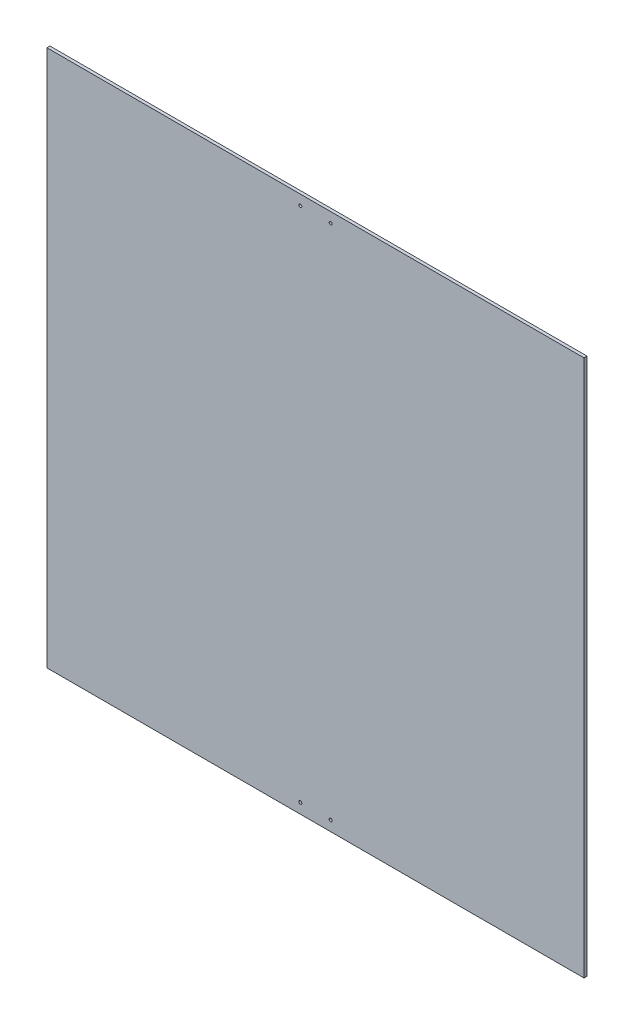
ISO-10303-21;
HEADER;
FILE_DESCRIPTION(('STEP AP214'),'2;1');
FILE_NAME('part.step','',(''),(''),'','','');
FILE_SCHEMA(('AUTOMOTIVE_DESIGN { 1 0 10303 214 1 1 1 1 }'));
ENDSEC;
DATA;
#1=APPLICATION_CONTEXT('core data for automotive mechanical design processes');
#2=APPLICATION_PROTOCOL_DEFINITION('international standard','automotive_design',2000,#1);
#3=PRODUCT_CONTEXT('',#1,'mechanical');
#4=PRODUCT('Part','Part','',(#3));
#5=PRODUCT_RELATED_PRODUCT_CATEGORY('part','',(#4));
#6=PRODUCT_DEFINITION_FORMATION('','',#4);
#7=PRODUCT_DEFINITION_CONTEXT('part definition',#1,'design');
#8=PRODUCT_DEFINITION('design','',#6,#7);
#9=PRODUCT_DEFINITION_SHAPE('','',#8);
#10=(LENGTH_UNIT() NAMED_UNIT(*) SI_UNIT(.MILLI.,.METRE.));
#11=(NAMED_UNIT(*) PLANE_ANGLE_UNIT() SI_UNIT($,.RADIAN.));
#12=(NAMED_UNIT(*) SI_UNIT($,.STERADIAN.) SOLID_ANGLE_UNIT());
#13=UNCERTAINTY_MEASURE_WITH_UNIT(LENGTH_MEASURE(1.E-05),#10,'distance_accuracy_value','');
#14=(GEOMETRIC_REPRESENTATION_CONTEXT(3) GLOBAL_UNCERTAINTY_ASSIGNED_CONTEXT((#13)) GLOBAL_UNIT_ASSIGNED_CONTEXT((#10,
#11,#12)) REPRESENTATION_CONTEXT('',''));
#15=CARTESIAN_POINT('',(0.,0.,0.));
#16=DIRECTION('',(0.,0.,1.));
#17=DIRECTION('',(1.,0.,0.));
#18=AXIS2_PLACEMENT_3D('',#15,#16,#17);
#19=CARTESIAN_POINT('',(0.,0.,3.));
#20=DIRECTION('',(-1.,0.,0.));
#21=DIRECTION('',(0.,0.,1.));
#22=AXIS2_PLACEMENT_3D('',#19,#20,#21);
#23=PLANE('',#22);
#24=DIRECTION('',(0.,1.,0.));
#25=VECTOR('',#24,1.);
#26=CARTESIAN_POINT('',(0.,0.,0.));
#27=LINE('',#26,#25);
#28=CARTESIAN_POINT('',(0.,0.,0.));
#29=VERTEX_POINT('',#28);
#30=CARTESIAN_POINT('',(0.,530.,0.));
#31=VERTEX_POINT('',#30);
#32=EDGE_CURVE('E96',#29,#31,#27,.T.);
#33=ORIENTED_EDGE('',*,*,#32,.T.);
#34=DIRECTION('',(0.,0.,-1.));
#35=VECTOR('',#34,1.);
#36=CARTESIAN_POINT('',(0.,530.,3.));
#37=LINE('',#36,#35);
#38=CARTESIAN_POINT('',(0.,530.,3.));
#39=VERTEX_POINT('',#38);
#40=EDGE_CURVE('E11',#39,#31,#37,.T.);
#41=ORIENTED_EDGE('',*,*,#40,.F.);
#42=DIRECTION('',(0.,1.,0.));
#43=VECTOR('',#42,1.);
#44=CARTESIAN_POINT('',(0.,0.,3.));
#45=LINE('',#44,#43);
#46=CARTESIAN_POINT('',(0.,0.,3.));
#47=VERTEX_POINT('',#46);
#48=EDGE_CURVE('E84',#47,#39,#45,.T.);
#49=ORIENTED_EDGE('',*,*,#48,.F.);
#50=DIRECTION('',(0.,0.,-1.));
#51=VECTOR('',#50,1.);
#52=CARTESIAN_POINT('',(0.,0.,3.));
#53=LINE('',#52,#51);
#54=EDGE_CURVE('E92',#47,#29,#53,.T.);
#55=ORIENTED_EDGE('',*,*,#54,.T.);
#56=EDGE_LOOP('',(#33,#41,#49,#55));
#57=FACE_BOUND('',#56,.T.);
#58=ADVANCED_FACE('F33',(#57),#23,.F.);
#59=CARTESIAN_POINT('',(0.,530.,3.));
#60=DIRECTION('',(0.,-1.,0.));
#61=DIRECTION('',(1.,0.,0.));
#62=AXIS2_PLACEMENT_3D('',#59,#60,#61);
#63=PLANE('',#62);
#64=DIRECTION('',(-1.,0.,0.));
#65=VECTOR('',#64,1.);
#66=CARTESIAN_POINT('',(0.,530.,0.));
#67=LINE('',#66,#65);
#68=CARTESIAN_POINT('',(-530.,530.,0.));
#69=VERTEX_POINT('',#68);
#70=EDGE_CURVE('E88',#31,#69,#67,.T.);
#71=ORIENTED_EDGE('',*,*,#70,.T.);
#72=DIRECTION('',(0.,0.,-1.));
#73=VECTOR('',#72,1.);
#74=CARTESIAN_POINT('',(-530.,530.,3.));
#75=LINE('',#74,#73);
#76=CARTESIAN_POINT('',(-530.,530.,3.));
#77=VERTEX_POINT('',#76);
#78=EDGE_CURVE('E41',#77,#69,#75,.T.);
#79=ORIENTED_EDGE('',*,*,#78,.F.);
#80=DIRECTION('',(-1.,0.,0.));
#81=VECTOR('',#80,1.);
#82=CARTESIAN_POINT('',(0.,530.,3.));
#83=LINE('',#82,#81);
#84=EDGE_CURVE('E79',#39,#77,#83,.T.);
#85=ORIENTED_EDGE('',*,*,#84,.F.);
#86=ORIENTED_EDGE('',*,*,#40,.T.);
#87=EDGE_LOOP('',(#71,#79,#85,#86));
#88=FACE_BOUND('',#87,.T.);
#89=ADVANCED_FACE('F87',(#88),#63,.F.);
#90=CARTESIAN_POINT('',(-530.,0.,3.));
#91=DIRECTION('',(1.,0.,0.));
#92=DIRECTION('',(0.,0.,-1.));
#93=AXIS2_PLACEMENT_3D('',#90,#91,#92);
#94=PLANE('',#93);
#95=DIRECTION('',(0.,-1.,0.));
#96=VECTOR('',#95,1.);
#97=CARTESIAN_POINT('',(-530.,0.,0.));
#98=LINE('',#97,#96);
#99=CARTESIAN_POINT('',(-530.,0.,0.));
#100=VERTEX_POINT('',#99);
#101=EDGE_CURVE('E66',#69,#100,#98,.T.);
#102=ORIENTED_EDGE('',*,*,#101,.T.);
#103=DIRECTION('',(0.,0.,-1.));
#104=VECTOR('',#103,1.);
#105=CARTESIAN_POINT('',(-530.,0.,3.));
#106=LINE('',#105,#104);
#107=CARTESIAN_POINT('',(-530.,0.,3.));
#108=VERTEX_POINT('',#107);
#109=EDGE_CURVE('E89',#108,#100,#106,.T.);
#110=ORIENTED_EDGE('',*,*,#109,.F.);
#111=DIRECTION('',(0.,-1.,0.));
#112=VECTOR('',#111,1.);
#113=CARTESIAN_POINT('',(-530.,0.,3.));
#114=LINE('',#113,#112);
#115=EDGE_CURVE('E82',#77,#108,#114,.T.);
#116=ORIENTED_EDGE('',*,*,#115,.F.);
#117=ORIENTED_EDGE('',*,*,#78,.T.);
#118=EDGE_LOOP('',(#102,#110,#116,#117));
#119=FACE_BOUND('',#118,.T.);
#120=ADVANCED_FACE('F90',(#119),#94,.F.);
#121=CARTESIAN_POINT('',(0.,0.,3.));
#122=DIRECTION('',(0.,1.,0.));
#123=DIRECTION('',(-1.,0.,0.));
#124=AXIS2_PLACEMENT_3D('',#121,#122,#123);
#125=PLANE('',#124);
#126=DIRECTION('',(1.,0.,0.));
#127=VECTOR('',#126,1.);
#128=CARTESIAN_POINT('',(0.,0.,0.));
#129=LINE('',#128,#127);
#130=EDGE_CURVE('E72',#100,#29,#129,.T.);
#131=ORIENTED_EDGE('',*,*,#130,.T.);
#132=ORIENTED_EDGE('',*,*,#54,.F.);
#133=DIRECTION('',(1.,0.,0.));
#134=VECTOR('',#133,1.);
#135=CARTESIAN_POINT('',(0.,0.,3.));
#136=LINE('',#135,#134);
#137=EDGE_CURVE('E49',#108,#47,#136,.T.);
#138=ORIENTED_EDGE('',*,*,#137,.F.);
#139=ORIENTED_EDGE('',*,*,#109,.T.);
#140=EDGE_LOOP('',(#131,#132,#138,#139));
#141=FACE_BOUND('',#140,.T.);
#142=ADVANCED_FACE('F104',(#141),#125,.F.);
#143=CARTESIAN_POINT('',(0.,530.,3.));
#144=DIRECTION('',(0.,0.,1.));
#145=DIRECTION('',(1.,0.,0.));
#146=AXIS2_PLACEMENT_3D('',#143,#144,#145);
#147=PLANE('',#146);
#148=CARTESIAN_POINT('',(-280.,520.,3.));
#149=DIRECTION('',(0.,0.,1.));
#150=DIRECTION('',(-1.,0.,0.));
#151=AXIS2_PLACEMENT_3D('',#148,#149,#150);
#152=CIRCLE('',#151,1.50000000000002);
#153=CARTESIAN_POINT('',(-281.5,520.,3.));
#154=VERTEX_POINT('',#153);
#155=EDGE_CURVE('E128',#154,#154,#152,.T.);
#156=ORIENTED_EDGE('',*,*,#155,.F.);
#157=EDGE_LOOP('',(#156));
#158=FACE_BOUND('',#157,.T.);
#159=CARTESIAN_POINT('',(-250.,520.,3.));
#160=DIRECTION('',(0.,0.,1.));
#161=DIRECTION('',(-1.,0.,0.));
#162=AXIS2_PLACEMENT_3D('',#159,#160,#161);
#163=CIRCLE('',#162,1.50000000000002);
#164=CARTESIAN_POINT('',(-251.5,520.,3.));
#165=VERTEX_POINT('',#164);
#166=EDGE_CURVE('E122',#165,#165,#163,.T.);
#167=ORIENTED_EDGE('',*,*,#166,.F.);
#168=EDGE_LOOP('',(#167));
#169=FACE_BOUND('',#168,.T.);
#170=CARTESIAN_POINT('',(-280.,10.,3.));
#171=DIRECTION('',(0.,0.,1.));
#172=DIRECTION('',(1.,0.,0.));
#173=AXIS2_PLACEMENT_3D('',#170,#171,#172);
#174=CIRCLE('',#173,1.50000000000002);
#175=CARTESIAN_POINT('',(-278.5,10.,3.));
#176=VERTEX_POINT('',#175);
#177=EDGE_CURVE('E116',#176,#176,#174,.T.);
#178=ORIENTED_EDGE('',*,*,#177,.F.);
#179=EDGE_LOOP('',(#178));
#180=FACE_BOUND('',#179,.T.);
#181=CARTESIAN_POINT('',(-250.,10.,3.));
#182=DIRECTION('',(0.,0.,1.));
#183=DIRECTION('',(1.,0.,0.));
#184=AXIS2_PLACEMENT_3D('',#181,#182,#183);
#185=CIRCLE('',#184,1.50000000000003);
#186=CARTESIAN_POINT('',(-248.5,10.,3.));
#187=VERTEX_POINT('',#186);
#188=EDGE_CURVE('E110',#187,#187,#185,.T.);
#189=ORIENTED_EDGE('',*,*,#188,.F.);
#190=EDGE_LOOP('',(#189));
#191=FACE_BOUND('',#190,.T.);
#192=ORIENTED_EDGE('',*,*,#48,.T.);
#193=ORIENTED_EDGE('',*,*,#84,.T.);
#194=ORIENTED_EDGE('',*,*,#115,.T.);
#195=ORIENTED_EDGE('',*,*,#137,.T.);
#196=EDGE_LOOP('',(#192,#193,#194,#195));
#197=FACE_BOUND('',#196,.T.);
#198=ADVANCED_FACE('F80',(#158,#169,#180,#191,#197),#147,.T.);
#199=CARTESIAN_POINT('',(0.,530.,0.));
#200=DIRECTION('',(0.,0.,1.));
#201=DIRECTION('',(1.,0.,0.));
#202=AXIS2_PLACEMENT_3D('',#199,#200,#201);
#203=PLANE('',#202);
#204=CARTESIAN_POINT('',(-280.,520.,0.));
#205=DIRECTION('',(0.,0.,1.));
#206=DIRECTION('',(-1.,0.,0.));
#207=AXIS2_PLACEMENT_3D('',#204,#205,#206);
#208=CIRCLE('',#207,1.50000000000002);
#209=CARTESIAN_POINT('',(-281.5,520.,0.));
#210=VERTEX_POINT('',#209);
#211=EDGE_CURVE('E125',#210,#210,#208,.T.);
#212=ORIENTED_EDGE('',*,*,#211,.T.);
#213=EDGE_LOOP('',(#212));
#214=FACE_BOUND('',#213,.T.);
#215=CARTESIAN_POINT('',(-250.,520.,0.));
#216=DIRECTION('',(0.,0.,1.));
#217=DIRECTION('',(-1.,0.,0.));
#218=AXIS2_PLACEMENT_3D('',#215,#216,#217);
#219=CIRCLE('',#218,1.50000000000002);
#220=CARTESIAN_POINT('',(-251.5,520.,0.));
#221=VERTEX_POINT('',#220);
#222=EDGE_CURVE('E119',#221,#221,#219,.T.);
#223=ORIENTED_EDGE('',*,*,#222,.T.);
#224=EDGE_LOOP('',(#223));
#225=FACE_BOUND('',#224,.T.);
#226=CARTESIAN_POINT('',(-280.,10.,0.));
#227=DIRECTION('',(0.,0.,1.));
#228=DIRECTION('',(1.,0.,0.));
#229=AXIS2_PLACEMENT_3D('',#226,#227,#228);
#230=CIRCLE('',#229,1.50000000000002);
#231=CARTESIAN_POINT('',(-278.5,10.,0.));
#232=VERTEX_POINT('',#231);
#233=EDGE_CURVE('E113',#232,#232,#230,.T.);
#234=ORIENTED_EDGE('',*,*,#233,.T.);
#235=EDGE_LOOP('',(#234));
#236=FACE_BOUND('',#235,.T.);
#237=CARTESIAN_POINT('',(-250.,10.,0.));
#238=DIRECTION('',(0.,0.,1.));
#239=DIRECTION('',(1.,0.,0.));
#240=AXIS2_PLACEMENT_3D('',#237,#238,#239);
#241=CIRCLE('',#240,1.50000000000003);
#242=CARTESIAN_POINT('',(-248.5,10.,0.));
#243=VERTEX_POINT('',#242);
#244=EDGE_CURVE('E99',#243,#243,#241,.T.);
#245=ORIENTED_EDGE('',*,*,#244,.T.);
#246=EDGE_LOOP('',(#245));
#247=FACE_BOUND('',#246,.T.);
#248=ORIENTED_EDGE('',*,*,#32,.F.);
#249=ORIENTED_EDGE('',*,*,#130,.F.);
#250=ORIENTED_EDGE('',*,*,#101,.F.);
#251=ORIENTED_EDGE('',*,*,#70,.F.);
#252=EDGE_LOOP('',(#248,#249,#250,#251));
#253=FACE_BOUND('',#252,.T.);
#254=ADVANCED_FACE('F107',(#214,#225,#236,#247,#253),#203,.F.);
#255=CARTESIAN_POINT('',(-250.,10.,0.));
#256=DIRECTION('',(0.,0.,1.));
#257=DIRECTION('',(1.,0.,0.));
#258=AXIS2_PLACEMENT_3D('',#255,#256,#257);
#259=CYLINDRICAL_SURFACE('',#258,1.50000000000003);
#260=ORIENTED_EDGE('',*,*,#244,.F.);
#261=EDGE_LOOP('',(#260));
#262=FACE_BOUND('',#261,.T.);
#263=ORIENTED_EDGE('',*,*,#188,.T.);
#264=EDGE_LOOP('',(#263));
#265=FACE_BOUND('',#264,.T.);
#266=ADVANCED_FACE('F152',(#262,#265),#259,.F.);
#267=CARTESIAN_POINT('',(-280.,10.,0.));
#268=DIRECTION('',(0.,0.,1.));
#269=DIRECTION('',(1.,0.,0.));
#270=AXIS2_PLACEMENT_3D('',#267,#268,#269);
#271=CYLINDRICAL_SURFACE('',#270,1.50000000000002);
#272=ORIENTED_EDGE('',*,*,#233,.F.);
#273=EDGE_LOOP('',(#272));
#274=FACE_BOUND('',#273,.T.);
#275=ORIENTED_EDGE('',*,*,#177,.T.);
#276=EDGE_LOOP('',(#275));
#277=FACE_BOUND('',#276,.T.);
#278=ADVANCED_FACE('F154',(#274,#277),#271,.F.);
#279=CARTESIAN_POINT('',(-250.,520.,0.));
#280=DIRECTION('',(0.,0.,1.));
#281=DIRECTION('',(1.,0.,0.));
#282=AXIS2_PLACEMENT_3D('',#279,#280,#281);
#283=CYLINDRICAL_SURFACE('',#282,1.50000000000002);
#284=ORIENTED_EDGE('',*,*,#222,.F.);
#285=EDGE_LOOP('',(#284));
#286=FACE_BOUND('',#285,.T.);
#287=ORIENTED_EDGE('',*,*,#166,.T.);
#288=EDGE_LOOP('',(#287));
#289=FACE_BOUND('',#288,.T.);
#290=ADVANCED_FACE('F139',(#286,#289),#283,.F.);
#291=CARTESIAN_POINT('',(-280.,520.,0.));
#292=DIRECTION('',(0.,0.,1.));
#293=DIRECTION('',(1.,0.,0.));
#294=AXIS2_PLACEMENT_3D('',#291,#292,#293);
#295=CYLINDRICAL_SURFACE('',#294,1.50000000000002);
#296=ORIENTED_EDGE('',*,*,#211,.F.);
#297=EDGE_LOOP('',(#296));
#298=FACE_BOUND('',#297,.T.);
#299=ORIENTED_EDGE('',*,*,#155,.T.);
#300=EDGE_LOOP('',(#299));
#301=FACE_BOUND('',#300,.T.);
#302=ADVANCED_FACE('F136',(#298,#301),#295,.F.);
#303=CLOSED_SHELL('',(#58,#89,#120,#142,#198,#254,#266,#278,#290,#302));
#304=MANIFOLD_SOLID_BREP('B2',#303);
#305=ADVANCED_BREP_SHAPE_REPRESENTATION('',(#18,#304),#14);
#306=SHAPE_DEFINITION_REPRESENTATION(#9,#305);
ENDSEC;
END-ISO-10303-21;
